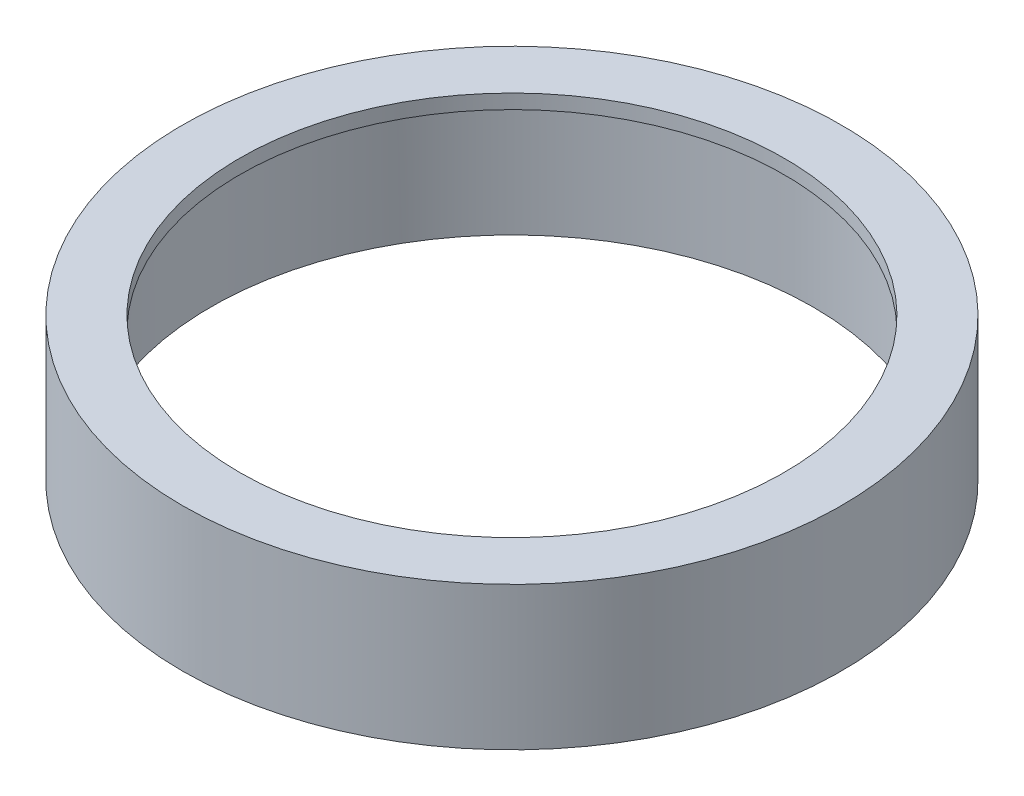
ISO-10303-21;
HEADER;
FILE_DESCRIPTION(('STEP AP214'),'2;1');
FILE_NAME('part.step','',(''),(''),'','','');
FILE_SCHEMA(('AUTOMOTIVE_DESIGN { 1 0 10303 214 1 1 1 1 }'));
ENDSEC;
DATA;
#1=APPLICATION_CONTEXT('core data for automotive mechanical design processes');
#2=APPLICATION_PROTOCOL_DEFINITION('international standard','automotive_design',2000,#1);
#3=PRODUCT_CONTEXT('',#1,'mechanical');
#4=PRODUCT('Part','Part','',(#3));
#5=PRODUCT_RELATED_PRODUCT_CATEGORY('part','',(#4));
#6=PRODUCT_DEFINITION_FORMATION('','',#4);
#7=PRODUCT_DEFINITION_CONTEXT('part definition',#1,'design');
#8=PRODUCT_DEFINITION('design','',#6,#7);
#9=PRODUCT_DEFINITION_SHAPE('','',#8);
#10=(LENGTH_UNIT() NAMED_UNIT(*) SI_UNIT(.MILLI.,.METRE.));
#11=(NAMED_UNIT(*) PLANE_ANGLE_UNIT() SI_UNIT($,.RADIAN.));
#12=(NAMED_UNIT(*) SI_UNIT($,.STERADIAN.) SOLID_ANGLE_UNIT());
#13=UNCERTAINTY_MEASURE_WITH_UNIT(LENGTH_MEASURE(1.E-05),#10,'distance_accuracy_value','');
#14=(GEOMETRIC_REPRESENTATION_CONTEXT(3) GLOBAL_UNCERTAINTY_ASSIGNED_CONTEXT((#13)) GLOBAL_UNIT_ASSIGNED_CONTEXT((#10,
#11,#12)) REPRESENTATION_CONTEXT('',''));
#15=CARTESIAN_POINT('',(0.,0.,0.));
#16=DIRECTION('',(0.,0.,1.));
#17=DIRECTION('',(1.,0.,0.));
#18=AXIS2_PLACEMENT_3D('',#15,#16,#17);
#19=CARTESIAN_POINT('',(0.,45.,0.));
#20=DIRECTION('',(0.,1.,0.));
#21=DIRECTION('',(0.,0.,1.));
#22=AXIS2_PLACEMENT_3D('',#19,#20,#21);
#23=PLANE('',#22);
#24=CARTESIAN_POINT('',(0.,45.,0.));
#25=DIRECTION('',(0.,1.,0.));
#26=DIRECTION('',(0.,0.,1.));
#27=AXIS2_PLACEMENT_3D('',#24,#25,#26);
#28=CIRCLE('',#27,95.);
#29=CARTESIAN_POINT('',(0.,45.,95.));
#30=VERTEX_POINT('',#29);
#31=EDGE_CURVE('E63',#30,#30,#28,.T.);
#32=ORIENTED_EDGE('',*,*,#31,.T.);
#33=EDGE_LOOP('',(#32));
#34=FACE_BOUND('',#33,.T.);
#35=CARTESIAN_POINT('',(0.,45.,0.));
#36=DIRECTION('',(0.,-1.,0.));
#37=DIRECTION('',(0.,0.,-1.));
#38=AXIS2_PLACEMENT_3D('',#35,#36,#37);
#39=CIRCLE('',#38,97.);
#40=CARTESIAN_POINT('',(0.,45.,-97.));
#41=VERTEX_POINT('',#40);
#42=EDGE_CURVE('E79',#41,#41,#39,.T.);
#43=ORIENTED_EDGE('',*,*,#42,.T.);
#44=EDGE_LOOP('',(#43));
#45=FACE_BOUND('',#44,.T.);
#46=ADVANCED_FACE('F43',(#34,#45),#23,.F.);
#47=CARTESIAN_POINT('',(0.,50.,0.));
#48=DIRECTION('',(0.,-1.,0.));
#49=DIRECTION('',(0.,0.,-1.));
#50=AXIS2_PLACEMENT_3D('',#47,#48,#49);
#51=CYLINDRICAL_SURFACE('',#50,105.05);
#52=CARTESIAN_POINT('',(0.,0.,0.));
#53=DIRECTION('',(0.,1.,0.));
#54=DIRECTION('',(0.,0.,1.));
#55=AXIS2_PLACEMENT_3D('',#52,#53,#54);
#56=CIRCLE('',#55,105.05);
#57=CARTESIAN_POINT('',(0.,0.,105.05));
#58=VERTEX_POINT('',#57);
#59=EDGE_CURVE('E58',#58,#58,#56,.T.);
#60=ORIENTED_EDGE('',*,*,#59,.F.);
#61=EDGE_LOOP('',(#60));
#62=FACE_BOUND('',#61,.T.);
#63=CARTESIAN_POINT('',(0.,48.,0.));
#64=DIRECTION('',(0.,-1.,0.));
#65=DIRECTION('',(0.,0.,-1.));
#66=AXIS2_PLACEMENT_3D('',#63,#64,#65);
#67=CIRCLE('',#66,105.05);
#68=CARTESIAN_POINT('',(0.,48.,-105.05));
#69=VERTEX_POINT('',#68);
#70=EDGE_CURVE('E68',#69,#69,#67,.T.);
#71=ORIENTED_EDGE('',*,*,#70,.F.);
#72=EDGE_LOOP('',(#71));
#73=FACE_BOUND('',#72,.T.);
#74=ADVANCED_FACE('F108',(#62,#73),#51,.F.);
#75=CARTESIAN_POINT('',(0.,50.,0.));
#76=DIRECTION('',(0.,1.,0.));
#77=DIRECTION('',(0.,0.,1.));
#78=AXIS2_PLACEMENT_3D('',#75,#76,#77);
#79=PLANE('',#78);
#80=CARTESIAN_POINT('',(0.,50.,0.));
#81=DIRECTION('',(0.,1.,0.));
#82=DIRECTION('',(0.,0.,1.));
#83=AXIS2_PLACEMENT_3D('',#80,#81,#82);
#84=CIRCLE('',#83,115.);
#85=CARTESIAN_POINT('',(0.,50.,115.));
#86=VERTEX_POINT('',#85);
#87=EDGE_CURVE('E10',#86,#86,#84,.T.);
#88=ORIENTED_EDGE('',*,*,#87,.T.);
#89=EDGE_LOOP('',(#88));
#90=FACE_BOUND('',#89,.T.);
#91=CARTESIAN_POINT('',(0.,50.,0.));
#92=DIRECTION('',(0.,1.,0.));
#93=DIRECTION('',(0.,0.,1.));
#94=AXIS2_PLACEMENT_3D('',#91,#92,#93);
#95=CIRCLE('',#94,95.);
#96=CARTESIAN_POINT('',(0.,50.,95.));
#97=VERTEX_POINT('',#96);
#98=EDGE_CURVE('E64',#97,#97,#95,.T.);
#99=ORIENTED_EDGE('',*,*,#98,.F.);
#100=EDGE_LOOP('',(#99));
#101=FACE_BOUND('',#100,.T.);
#102=ADVANCED_FACE('F114',(#90,#101),#79,.T.);
#103=CARTESIAN_POINT('',(0.,0.,0.));
#104=DIRECTION('',(0.,1.,0.));
#105=DIRECTION('',(0.,0.,1.));
#106=AXIS2_PLACEMENT_3D('',#103,#104,#105);
#107=PLANE('',#106);
#108=CARTESIAN_POINT('',(0.,0.,0.));
#109=DIRECTION('',(0.,1.,0.));
#110=DIRECTION('',(0.,0.,1.));
#111=AXIS2_PLACEMENT_3D('',#108,#109,#110);
#112=CIRCLE('',#111,115.);
#113=CARTESIAN_POINT('',(0.,0.,115.));
#114=VERTEX_POINT('',#113);
#115=EDGE_CURVE('E52',#114,#114,#112,.T.);
#116=ORIENTED_EDGE('',*,*,#115,.F.);
#117=EDGE_LOOP('',(#116));
#118=FACE_BOUND('',#117,.T.);
#119=ORIENTED_EDGE('',*,*,#59,.T.);
#120=EDGE_LOOP('',(#119));
#121=FACE_BOUND('',#120,.T.);
#122=ADVANCED_FACE('F119',(#118,#121),#107,.F.);
#123=CARTESIAN_POINT('',(0.,50.,0.));
#124=DIRECTION('',(0.,-1.,0.));
#125=DIRECTION('',(0.,0.,-1.));
#126=AXIS2_PLACEMENT_3D('',#123,#124,#125);
#127=CYLINDRICAL_SURFACE('',#126,115.);
#128=ORIENTED_EDGE('',*,*,#87,.F.);
#129=EDGE_LOOP('',(#128));
#130=FACE_BOUND('',#129,.T.);
#131=ORIENTED_EDGE('',*,*,#115,.T.);
#132=EDGE_LOOP('',(#131));
#133=FACE_BOUND('',#132,.T.);
#134=ADVANCED_FACE('F45',(#130,#133),#127,.T.);
#135=CARTESIAN_POINT('',(0.,45.,0.));
#136=DIRECTION('',(0.,1.,0.));
#137=DIRECTION('',(0.,0.,1.));
#138=AXIS2_PLACEMENT_3D('',#135,#136,#137);
#139=CYLINDRICAL_SURFACE('',#138,95.);
#140=ORIENTED_EDGE('',*,*,#31,.F.);
#141=EDGE_LOOP('',(#140));
#142=FACE_BOUND('',#141,.T.);
#143=ORIENTED_EDGE('',*,*,#98,.T.);
#144=EDGE_LOOP('',(#143));
#145=FACE_BOUND('',#144,.T.);
#146=ADVANCED_FACE('F99',(#142,#145),#139,.F.);
#147=CARTESIAN_POINT('',(0.,48.,0.));
#148=DIRECTION('',(0.,-1.,0.));
#149=DIRECTION('',(0.,0.,-1.));
#150=AXIS2_PLACEMENT_3D('',#147,#148,#149);
#151=PLANE('',#150);
#152=ORIENTED_EDGE('',*,*,#70,.T.);
#153=EDGE_LOOP('',(#152));
#154=FACE_BOUND('',#153,.T.);
#155=CARTESIAN_POINT('',(0.,48.,0.));
#156=DIRECTION('',(0.,-1.,0.));
#157=DIRECTION('',(0.,0.,-1.));
#158=AXIS2_PLACEMENT_3D('',#155,#156,#157);
#159=CIRCLE('',#158,101.75);
#160=CARTESIAN_POINT('',(0.,48.,-101.75));
#161=VERTEX_POINT('',#160);
#162=EDGE_CURVE('E75',#161,#161,#159,.T.);
#163=ORIENTED_EDGE('',*,*,#162,.F.);
#164=EDGE_LOOP('',(#163));
#165=FACE_BOUND('',#164,.T.);
#166=ADVANCED_FACE('F94',(#154,#165),#151,.T.);
#167=CARTESIAN_POINT('',(0.,48.,0.));
#168=DIRECTION('',(0.,-1.,0.));
#169=DIRECTION('',(0.,0.,-1.));
#170=AXIS2_PLACEMENT_3D('',#167,#168,#169);
#171=CYLINDRICAL_SURFACE('',#170,101.75);
#172=CARTESIAN_POINT('',(0.,47.85,0.));
#173=DIRECTION('',(0.,1.,0.));
#174=DIRECTION('',(0.,0.,1.));
#175=AXIS2_PLACEMENT_3D('',#172,#173,#174);
#176=CIRCLE('',#175,101.75);
#177=CARTESIAN_POINT('',(0.,47.85,101.75));
#178=VERTEX_POINT('',#177);
#179=EDGE_CURVE('E47',#178,#178,#176,.F.);
#180=ORIENTED_EDGE('',*,*,#179,.F.);
#181=EDGE_LOOP('',(#180));
#182=FACE_BOUND('',#181,.T.);
#183=ORIENTED_EDGE('',*,*,#162,.T.);
#184=EDGE_LOOP('',(#183));
#185=FACE_BOUND('',#184,.T.);
#186=ADVANCED_FACE('F91',(#182,#185),#171,.T.);
#187=CARTESIAN_POINT('',(0.,48.,0.));
#188=DIRECTION('',(0.,1.,0.));
#189=DIRECTION('',(0.,0.,1.));
#190=AXIS2_PLACEMENT_3D('',#187,#188,#189);
#191=CONICAL_SURFACE('',#190,102.,1.03037682652431);
#192=ORIENTED_EDGE('',*,*,#179,.T.);
#193=EDGE_LOOP('',(#192));
#194=FACE_BOUND('',#193,.T.);
#195=ORIENTED_EDGE('',*,*,#42,.F.);
#196=EDGE_LOOP('',(#195));
#197=FACE_BOUND('',#196,.T.);
#198=ADVANCED_FACE('F88',(#194,#197),#191,.T.);
#199=CLOSED_SHELL('',(#46,#74,#102,#122,#134,#146,#166,#186,#198));
#200=MANIFOLD_SOLID_BREP('B2',#199);
#201=ADVANCED_BREP_SHAPE_REPRESENTATION('',(#18,#200),#14);
#202=SHAPE_DEFINITION_REPRESENTATION(#9,#201);
ENDSEC;
END-ISO-10303-21;
